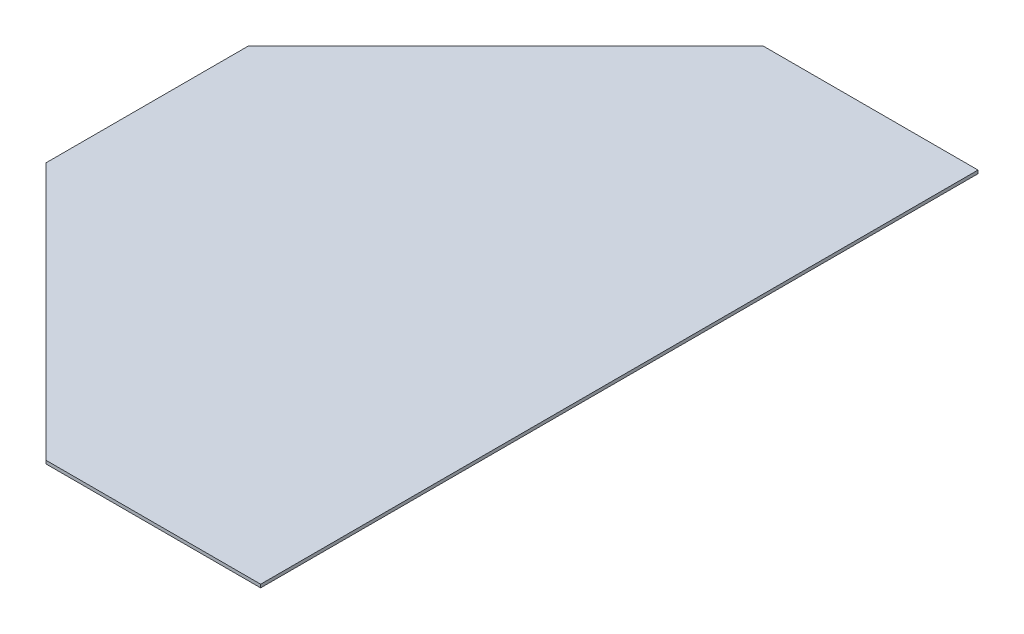
ISO-10303-21;
HEADER;
FILE_DESCRIPTION(('STEP AP214'),'2;1');
FILE_NAME('part.step','',(''),(''),'','','');
FILE_SCHEMA(('AUTOMOTIVE_DESIGN { 1 0 10303 214 1 1 1 1 }'));
ENDSEC;
DATA;
#1=APPLICATION_CONTEXT('core data for automotive mechanical design processes');
#2=APPLICATION_PROTOCOL_DEFINITION('international standard','automotive_design',2000,#1);
#3=PRODUCT_CONTEXT('',#1,'mechanical');
#4=PRODUCT('Part','Part','',(#3));
#5=PRODUCT_RELATED_PRODUCT_CATEGORY('part','',(#4));
#6=PRODUCT_DEFINITION_FORMATION('','',#4);
#7=PRODUCT_DEFINITION_CONTEXT('part definition',#1,'design');
#8=PRODUCT_DEFINITION('design','',#6,#7);
#9=PRODUCT_DEFINITION_SHAPE('','',#8);
#10=(LENGTH_UNIT() NAMED_UNIT(*) SI_UNIT(.MILLI.,.METRE.));
#11=(NAMED_UNIT(*) PLANE_ANGLE_UNIT() SI_UNIT($,.RADIAN.));
#12=(NAMED_UNIT(*) SI_UNIT($,.STERADIAN.) SOLID_ANGLE_UNIT());
#13=UNCERTAINTY_MEASURE_WITH_UNIT(LENGTH_MEASURE(1.E-05),#10,'distance_accuracy_value','');
#14=(GEOMETRIC_REPRESENTATION_CONTEXT(3) GLOBAL_UNCERTAINTY_ASSIGNED_CONTEXT((#13)) GLOBAL_UNIT_ASSIGNED_CONTEXT((#10,
#11,#12)) REPRESENTATION_CONTEXT('',''));
#15=CARTESIAN_POINT('',(0.,0.,0.));
#16=DIRECTION('',(0.,0.,1.));
#17=DIRECTION('',(1.,0.,0.));
#18=AXIS2_PLACEMENT_3D('',#15,#16,#17);
#19=CARTESIAN_POINT('',(0.,3.,0.));
#20=DIRECTION('',(1.,0.,0.));
#21=DIRECTION('',(0.,0.,-1.));
#22=AXIS2_PLACEMENT_3D('',#19,#20,#21);
#23=PLANE('',#22);
#24=DIRECTION('',(0.,-1.,0.));
#25=VECTOR('',#24,1.);
#26=CARTESIAN_POINT('',(0.,3.,-240.));
#27=LINE('',#26,#25);
#28=CARTESIAN_POINT('',(0.,3.,-240.));
#29=VERTEX_POINT('',#28);
#30=CARTESIAN_POINT('',(0.,0.,-240.));
#31=VERTEX_POINT('',#30);
#32=EDGE_CURVE('E62',#29,#31,#27,.T.);
#33=ORIENTED_EDGE('',*,*,#32,.F.);
#34=DIRECTION('',(0.,0.,1.));
#35=VECTOR('',#34,1.);
#36=CARTESIAN_POINT('',(0.,3.,0.));
#37=LINE('',#36,#35);
#38=CARTESIAN_POINT('',(0.,3.,-428.38));
#39=VERTEX_POINT('',#38);
#40=EDGE_CURVE('E105',#39,#29,#37,.T.);
#41=ORIENTED_EDGE('',*,*,#40,.F.);
#42=DIRECTION('',(0.,-1.,0.));
#43=VECTOR('',#42,1.);
#44=CARTESIAN_POINT('',(0.,3.,-428.38));
#45=LINE('',#44,#43);
#46=CARTESIAN_POINT('',(0.,0.,-428.38));
#47=VERTEX_POINT('',#46);
#48=EDGE_CURVE('E142',#39,#47,#45,.T.);
#49=ORIENTED_EDGE('',*,*,#48,.T.);
#50=DIRECTION('',(0.,0.,1.));
#51=VECTOR('',#50,1.);
#52=CARTESIAN_POINT('',(0.,0.,0.));
#53=LINE('',#52,#51);
#54=EDGE_CURVE('E102',#47,#31,#53,.T.);
#55=ORIENTED_EDGE('',*,*,#54,.T.);
#56=EDGE_LOOP('',(#33,#41,#49,#55));
#57=FACE_BOUND('',#56,.T.);
#58=ADVANCED_FACE('F39',(#57),#23,.F.);
#59=CARTESIAN_POINT('',(0.,3.,-668.38));
#60=DIRECTION('',(0.,0.,1.));
#61=DIRECTION('',(1.,0.,0.));
#62=AXIS2_PLACEMENT_3D('',#59,#60,#61);
#63=PLANE('',#62);
#64=DIRECTION('',(0.,-1.,0.));
#65=VECTOR('',#64,1.);
#66=CARTESIAN_POINT('',(240.,3.,-668.38));
#67=LINE('',#66,#65);
#68=CARTESIAN_POINT('',(240.,3.,-668.38));
#69=VERTEX_POINT('',#68);
#70=CARTESIAN_POINT('',(240.,0.,-668.38));
#71=VERTEX_POINT('',#70);
#72=EDGE_CURVE('E52',#69,#71,#67,.T.);
#73=ORIENTED_EDGE('',*,*,#72,.F.);
#74=DIRECTION('',(-1.,0.,0.));
#75=VECTOR('',#74,1.);
#76=CARTESIAN_POINT('',(0.,3.,-668.38));
#77=LINE('',#76,#75);
#78=CARTESIAN_POINT('',(440.,3.,-668.38));
#79=VERTEX_POINT('',#78);
#80=EDGE_CURVE('E122',#79,#69,#77,.T.);
#81=ORIENTED_EDGE('',*,*,#80,.F.);
#82=DIRECTION('',(0.,-1.,0.));
#83=VECTOR('',#82,1.);
#84=CARTESIAN_POINT('',(440.,3.,-668.38));
#85=LINE('',#84,#83);
#86=CARTESIAN_POINT('',(440.,0.,-668.38));
#87=VERTEX_POINT('',#86);
#88=EDGE_CURVE('E46',#79,#87,#85,.T.);
#89=ORIENTED_EDGE('',*,*,#88,.T.);
#90=DIRECTION('',(-1.,0.,0.));
#91=VECTOR('',#90,1.);
#92=CARTESIAN_POINT('',(0.,0.,-668.38));
#93=LINE('',#92,#91);
#94=EDGE_CURVE('E112',#87,#71,#93,.T.);
#95=ORIENTED_EDGE('',*,*,#94,.T.);
#96=EDGE_LOOP('',(#73,#81,#89,#95));
#97=FACE_BOUND('',#96,.T.);
#98=ADVANCED_FACE('F135',(#97),#63,.F.);
#99=CARTESIAN_POINT('',(0.,3.,0.));
#100=DIRECTION('',(0.,0.,-1.));
#101=DIRECTION('',(-1.,0.,0.));
#102=AXIS2_PLACEMENT_3D('',#99,#100,#101);
#103=PLANE('',#102);
#104=DIRECTION('',(1.,0.,0.));
#105=VECTOR('',#104,1.);
#106=CARTESIAN_POINT('',(0.,3.,0.));
#107=LINE('',#106,#105);
#108=CARTESIAN_POINT('',(240.,3.,0.));
#109=VERTEX_POINT('',#108);
#110=CARTESIAN_POINT('',(440.,3.,0.));
#111=VERTEX_POINT('',#110);
#112=EDGE_CURVE('E109',#109,#111,#107,.T.);
#113=ORIENTED_EDGE('',*,*,#112,.F.);
#114=DIRECTION('',(0.,-1.,0.));
#115=VECTOR('',#114,1.);
#116=CARTESIAN_POINT('',(240.,3.,0.));
#117=LINE('',#116,#115);
#118=CARTESIAN_POINT('',(240.,0.,0.));
#119=VERTEX_POINT('',#118);
#120=EDGE_CURVE('E95',#109,#119,#117,.T.);
#121=ORIENTED_EDGE('',*,*,#120,.T.);
#122=DIRECTION('',(1.,0.,0.));
#123=VECTOR('',#122,1.);
#124=CARTESIAN_POINT('',(0.,0.,0.));
#125=LINE('',#124,#123);
#126=CARTESIAN_POINT('',(440.,0.,0.));
#127=VERTEX_POINT('',#126);
#128=EDGE_CURVE('E125',#119,#127,#125,.T.);
#129=ORIENTED_EDGE('',*,*,#128,.T.);
#130=DIRECTION('',(0.,-1.,0.));
#131=VECTOR('',#130,1.);
#132=CARTESIAN_POINT('',(440.,3.,0.));
#133=LINE('',#132,#131);
#134=EDGE_CURVE('E11',#111,#127,#133,.T.);
#135=ORIENTED_EDGE('',*,*,#134,.F.);
#136=EDGE_LOOP('',(#113,#121,#129,#135));
#137=FACE_BOUND('',#136,.T.);
#138=ADVANCED_FACE('F148',(#137),#103,.F.);
#139=CARTESIAN_POINT('',(440.,3.,0.));
#140=DIRECTION('',(-1.,0.,0.));
#141=DIRECTION('',(0.,0.,1.));
#142=AXIS2_PLACEMENT_3D('',#139,#140,#141);
#143=PLANE('',#142);
#144=DIRECTION('',(0.,0.,-1.));
#145=VECTOR('',#144,1.);
#146=CARTESIAN_POINT('',(440.,0.,0.));
#147=LINE('',#146,#145);
#148=EDGE_CURVE('E117',#127,#87,#147,.T.);
#149=ORIENTED_EDGE('',*,*,#148,.T.);
#150=ORIENTED_EDGE('',*,*,#88,.F.);
#151=DIRECTION('',(0.,0.,-1.));
#152=VECTOR('',#151,1.);
#153=CARTESIAN_POINT('',(440.,3.,0.));
#154=LINE('',#153,#152);
#155=EDGE_CURVE('E114',#111,#79,#154,.T.);
#156=ORIENTED_EDGE('',*,*,#155,.F.);
#157=ORIENTED_EDGE('',*,*,#134,.T.);
#158=EDGE_LOOP('',(#149,#150,#156,#157));
#159=FACE_BOUND('',#158,.T.);
#160=ADVANCED_FACE('F146',(#159),#143,.F.);
#161=CARTESIAN_POINT('',(0.,3.,0.));
#162=DIRECTION('',(0.,-1.,0.));
#163=DIRECTION('',(0.,0.,-1.));
#164=AXIS2_PLACEMENT_3D('',#161,#162,#163);
#165=PLANE('',#164);
#166=ORIENTED_EDGE('',*,*,#40,.T.);
#167=DIRECTION('',(0.707106781186547,0.,0.707106781186547));
#168=VECTOR('',#167,1.);
#169=CARTESIAN_POINT('',(240.,3.,0.));
#170=LINE('',#169,#168);
#171=EDGE_CURVE('E90',#29,#109,#170,.T.);
#172=ORIENTED_EDGE('',*,*,#171,.T.);
#173=ORIENTED_EDGE('',*,*,#112,.T.);
#174=ORIENTED_EDGE('',*,*,#155,.T.);
#175=ORIENTED_EDGE('',*,*,#80,.T.);
#176=DIRECTION('',(-0.707106781186547,0.,0.707106781186547));
#177=VECTOR('',#176,1.);
#178=CARTESIAN_POINT('',(0.,3.,-428.38));
#179=LINE('',#178,#177);
#180=EDGE_CURVE('E108',#69,#39,#179,.T.);
#181=ORIENTED_EDGE('',*,*,#180,.T.);
#182=EDGE_LOOP('',(#166,#172,#173,#174,#175,#181));
#183=FACE_BOUND('',#182,.T.);
#184=ADVANCED_FACE('F110',(#183),#165,.F.);
#185=CARTESIAN_POINT('',(0.,0.,0.));
#186=DIRECTION('',(0.,-1.,0.));
#187=DIRECTION('',(0.,0.,-1.));
#188=AXIS2_PLACEMENT_3D('',#185,#186,#187);
#189=PLANE('',#188);
#190=DIRECTION('',(0.707106781186547,0.,0.707106781186547));
#191=VECTOR('',#190,1.);
#192=CARTESIAN_POINT('',(240.,0.,0.));
#193=LINE('',#192,#191);
#194=EDGE_CURVE('E96',#31,#119,#193,.T.);
#195=ORIENTED_EDGE('',*,*,#194,.F.);
#196=ORIENTED_EDGE('',*,*,#54,.F.);
#197=DIRECTION('',(-0.707106781186547,0.,0.707106781186547));
#198=VECTOR('',#197,1.);
#199=CARTESIAN_POINT('',(0.,0.,-428.38));
#200=LINE('',#199,#198);
#201=EDGE_CURVE('E138',#71,#47,#200,.T.);
#202=ORIENTED_EDGE('',*,*,#201,.F.);
#203=ORIENTED_EDGE('',*,*,#94,.F.);
#204=ORIENTED_EDGE('',*,*,#148,.F.);
#205=ORIENTED_EDGE('',*,*,#128,.F.);
#206=EDGE_LOOP('',(#195,#196,#202,#203,#204,#205));
#207=FACE_BOUND('',#206,.T.);
#208=ADVANCED_FACE('F137',(#207),#189,.T.);
#209=CARTESIAN_POINT('',(0.,3.,-428.38));
#210=DIRECTION('',(0.707106781186548,0.,0.707106781186548));
#211=DIRECTION('',(0.707106781186548,0.,-0.707106781186548));
#212=AXIS2_PLACEMENT_3D('',#209,#210,#211);
#213=PLANE('',#212);
#214=ORIENTED_EDGE('',*,*,#201,.T.);
#215=ORIENTED_EDGE('',*,*,#48,.F.);
#216=ORIENTED_EDGE('',*,*,#180,.F.);
#217=ORIENTED_EDGE('',*,*,#72,.T.);
#218=EDGE_LOOP('',(#214,#215,#216,#217));
#219=FACE_BOUND('',#218,.T.);
#220=ADVANCED_FACE('F164',(#219),#213,.F.);
#221=CARTESIAN_POINT('',(240.,3.,0.));
#222=DIRECTION('',(0.707106781186548,0.,-0.707106781186548));
#223=DIRECTION('',(-0.707106781186548,0.,-0.707106781186548));
#224=AXIS2_PLACEMENT_3D('',#221,#222,#223);
#225=PLANE('',#224);
#226=ORIENTED_EDGE('',*,*,#194,.T.);
#227=ORIENTED_EDGE('',*,*,#120,.F.);
#228=ORIENTED_EDGE('',*,*,#171,.F.);
#229=ORIENTED_EDGE('',*,*,#32,.T.);
#230=EDGE_LOOP('',(#226,#227,#228,#229));
#231=FACE_BOUND('',#230,.T.);
#232=ADVANCED_FACE('F89',(#231),#225,.F.);
#233=CLOSED_SHELL('',(#58,#98,#138,#160,#184,#208,#220,#232));
#234=MANIFOLD_SOLID_BREP('B2',#233);
#235=ADVANCED_BREP_SHAPE_REPRESENTATION('',(#18,#234),#14);
#236=SHAPE_DEFINITION_REPRESENTATION(#9,#235);
ENDSEC;
END-ISO-10303-21;
